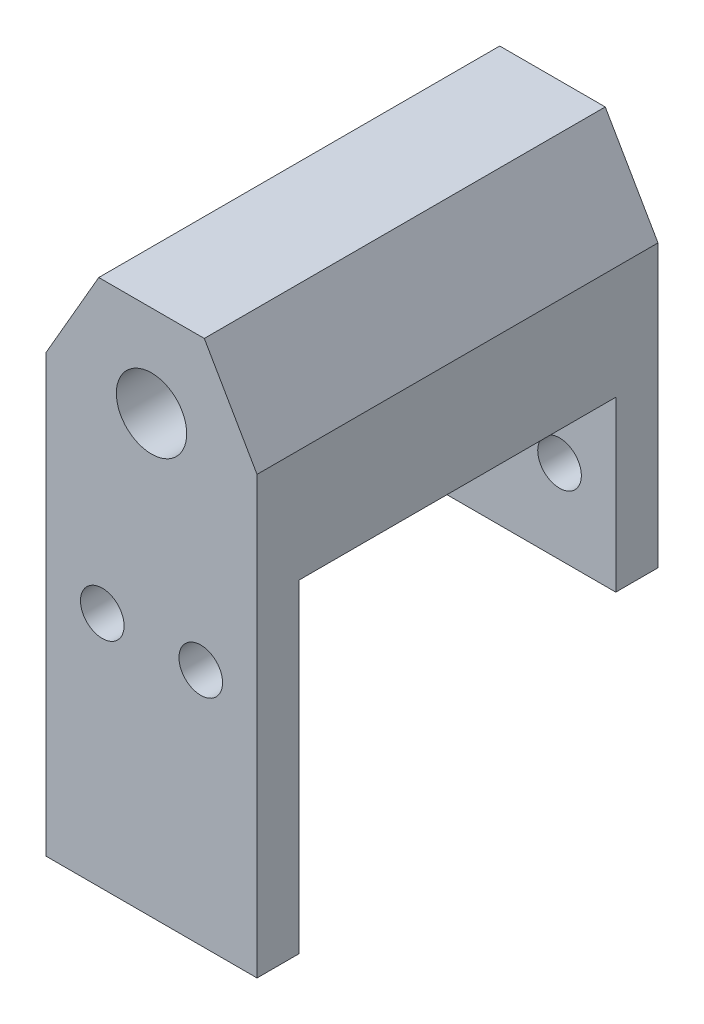
ISO-10303-21;
HEADER;
FILE_DESCRIPTION(('STEP AP214'),'2;1');
FILE_NAME('part.step','',(''),(''),'','','');
FILE_SCHEMA(('AUTOMOTIVE_DESIGN { 1 0 10303 214 1 1 1 1 }'));
ENDSEC;
DATA;
#1=APPLICATION_CONTEXT('core data for automotive mechanical design processes');
#2=APPLICATION_PROTOCOL_DEFINITION('international standard','automotive_design',2000,#1);
#3=PRODUCT_CONTEXT('',#1,'mechanical');
#4=PRODUCT('Part','Part','',(#3));
#5=PRODUCT_RELATED_PRODUCT_CATEGORY('part','',(#4));
#6=PRODUCT_DEFINITION_FORMATION('','',#4);
#7=PRODUCT_DEFINITION_CONTEXT('part definition',#1,'design');
#8=PRODUCT_DEFINITION('design','',#6,#7);
#9=PRODUCT_DEFINITION_SHAPE('','',#8);
#10=(LENGTH_UNIT() NAMED_UNIT(*) SI_UNIT(.MILLI.,.METRE.));
#11=(NAMED_UNIT(*) PLANE_ANGLE_UNIT() SI_UNIT($,.RADIAN.));
#12=(NAMED_UNIT(*) SI_UNIT($,.STERADIAN.) SOLID_ANGLE_UNIT());
#13=UNCERTAINTY_MEASURE_WITH_UNIT(LENGTH_MEASURE(1.E-05),#10,'distance_accuracy_value','');
#14=(GEOMETRIC_REPRESENTATION_CONTEXT(3) GLOBAL_UNCERTAINTY_ASSIGNED_CONTEXT((#13)) GLOBAL_UNIT_ASSIGNED_CONTEXT((#10,
#11,#12)) REPRESENTATION_CONTEXT('',''));
#15=CARTESIAN_POINT('',(0.,0.,0.));
#16=DIRECTION('',(0.,0.,1.));
#17=DIRECTION('',(1.,0.,0.));
#18=AXIS2_PLACEMENT_3D('',#15,#16,#17);
#19=CARTESIAN_POINT('',(-7.5,-8.,28.5));
#20=DIRECTION('',(0.,1.,0.));
#21=DIRECTION('',(0.,0.,1.));
#22=AXIS2_PLACEMENT_3D('',#19,#20,#21);
#23=PLANE('',#22);
#24=DIRECTION('',(-1.,0.,0.));
#25=VECTOR('',#24,1.);
#26=CARTESIAN_POINT('',(0.,-8.,3.));
#27=LINE('',#26,#25);
#28=CARTESIAN_POINT('',(7.5,-8.,3.00000000000001));
#29=VERTEX_POINT('',#28);
#30=CARTESIAN_POINT('',(-7.5,-8.,3.00000000000001));
#31=VERTEX_POINT('',#30);
#32=EDGE_CURVE('E62',#29,#31,#27,.T.);
#33=ORIENTED_EDGE('',*,*,#32,.F.);
#34=DIRECTION('',(0.,0.,-1.));
#35=VECTOR('',#34,1.);
#36=CARTESIAN_POINT('',(7.5,-8.,28.5));
#37=LINE('',#36,#35);
#38=CARTESIAN_POINT('',(7.5,-8.,25.5));
#39=VERTEX_POINT('',#38);
#40=EDGE_CURVE('E142',#39,#29,#37,.T.);
#41=ORIENTED_EDGE('',*,*,#40,.F.);
#42=DIRECTION('',(1.,0.,0.));
#43=VECTOR('',#42,1.);
#44=CARTESIAN_POINT('',(0.,-8.,25.5));
#45=LINE('',#44,#43);
#46=CARTESIAN_POINT('',(-7.5,-8.,25.5));
#47=VERTEX_POINT('',#46);
#48=EDGE_CURVE('E144',#47,#39,#45,.T.);
#49=ORIENTED_EDGE('',*,*,#48,.F.);
#50=DIRECTION('',(0.,0.,-1.));
#51=VECTOR('',#50,1.);
#52=CARTESIAN_POINT('',(-7.5,-8.,28.5));
#53=LINE('',#52,#51);
#54=EDGE_CURVE('E51',#47,#31,#53,.T.);
#55=ORIENTED_EDGE('',*,*,#54,.T.);
#56=EDGE_LOOP('',(#33,#41,#49,#55));
#57=FACE_BOUND('',#56,.T.);
#58=ADVANCED_FACE('F41',(#57),#23,.F.);
#59=CARTESIAN_POINT('',(-3.75000000000008,6.49519052838325,28.5));
#60=DIRECTION('',(0.86602540378444,-0.499999999999998,0.));
#61=DIRECTION('',(0.499999999999998,0.86602540378444,0.));
#62=AXIS2_PLACEMENT_3D('',#59,#60,#61);
#63=PLANE('',#62);
#64=DIRECTION('',(-0.499999999999998,-0.86602540378444,0.));
#65=VECTOR('',#64,1.);
#66=CARTESIAN_POINT('',(-3.75000000000008,6.49519052838325,0.));
#67=LINE('',#66,#65);
#68=CARTESIAN_POINT('',(-3.75000000000008,6.49519052838325,0.));
#69=VERTEX_POINT('',#68);
#70=CARTESIAN_POINT('',(-7.5,0.,0.));
#71=VERTEX_POINT('',#70);
#72=EDGE_CURVE('E176',#69,#71,#67,.T.);
#73=ORIENTED_EDGE('',*,*,#72,.T.);
#74=DIRECTION('',(0.,0.,-1.));
#75=VECTOR('',#74,1.);
#76=CARTESIAN_POINT('',(-7.5,0.,28.5));
#77=LINE('',#76,#75);
#78=CARTESIAN_POINT('',(-7.5,0.,28.5));
#79=VERTEX_POINT('',#78);
#80=EDGE_CURVE('E11',#79,#71,#77,.T.);
#81=ORIENTED_EDGE('',*,*,#80,.F.);
#82=DIRECTION('',(-0.499999999999998,-0.86602540378444,0.));
#83=VECTOR('',#82,1.);
#84=CARTESIAN_POINT('',(-3.75000000000008,6.49519052838325,28.5));
#85=LINE('',#84,#83);
#86=CARTESIAN_POINT('',(-3.75000000000008,6.49519052838325,28.5));
#87=VERTEX_POINT('',#86);
#88=EDGE_CURVE('E177',#87,#79,#85,.T.);
#89=ORIENTED_EDGE('',*,*,#88,.F.);
#90=DIRECTION('',(0.,0.,-1.));
#91=VECTOR('',#90,1.);
#92=CARTESIAN_POINT('',(-3.75000000000008,6.49519052838325,28.5));
#93=LINE('',#92,#91);
#94=EDGE_CURVE('E194',#87,#69,#93,.T.);
#95=ORIENTED_EDGE('',*,*,#94,.T.);
#96=EDGE_LOOP('',(#73,#81,#89,#95));
#97=FACE_BOUND('',#96,.T.);
#98=ADVANCED_FACE('F43',(#97),#63,.F.);
#99=CARTESIAN_POINT('',(-7.5,0.,28.5));
#100=DIRECTION('',(1.,0.,0.));
#101=DIRECTION('',(0.,1.,0.));
#102=AXIS2_PLACEMENT_3D('',#99,#100,#101);
#103=PLANE('',#102);
#104=DIRECTION('',(0.,-1.,0.));
#105=VECTOR('',#104,1.);
#106=CARTESIAN_POINT('',(-7.5,0.,0.));
#107=LINE('',#106,#105);
#108=CARTESIAN_POINT('',(-7.5,-20.,0.));
#109=VERTEX_POINT('',#108);
#110=EDGE_CURVE('E198',#71,#109,#107,.T.);
#111=ORIENTED_EDGE('',*,*,#110,.T.);
#112=DIRECTION('',(0.,0.,-1.));
#113=VECTOR('',#112,1.);
#114=CARTESIAN_POINT('',(-7.5,-20.,0.));
#115=LINE('',#114,#113);
#116=CARTESIAN_POINT('',(-7.5,-20.,3.));
#117=VERTEX_POINT('',#116);
#118=EDGE_CURVE('E129',#117,#109,#115,.T.);
#119=ORIENTED_EDGE('',*,*,#118,.F.);
#120=DIRECTION('',(0.,1.,0.));
#121=VECTOR('',#120,1.);
#122=CARTESIAN_POINT('',(-7.5,-20.,3.));
#123=LINE('',#122,#121);
#124=EDGE_CURVE('E124',#117,#31,#123,.T.);
#125=ORIENTED_EDGE('',*,*,#124,.T.);
#126=ORIENTED_EDGE('',*,*,#54,.F.);
#127=DIRECTION('',(0.,1.,0.));
#128=VECTOR('',#127,1.);
#129=CARTESIAN_POINT('',(-7.5,-31.,25.5));
#130=LINE('',#129,#128);
#131=CARTESIAN_POINT('',(-7.5,-31.,25.5));
#132=VERTEX_POINT('',#131);
#133=EDGE_CURVE('E172',#132,#47,#130,.T.);
#134=ORIENTED_EDGE('',*,*,#133,.F.);
#135=DIRECTION('',(0.,0.,-1.));
#136=VECTOR('',#135,1.);
#137=CARTESIAN_POINT('',(-7.5,-31.,0.));
#138=LINE('',#137,#136);
#139=CARTESIAN_POINT('',(-7.5,-31.,28.5));
#140=VERTEX_POINT('',#139);
#141=EDGE_CURVE('E150',#140,#132,#138,.T.);
#142=ORIENTED_EDGE('',*,*,#141,.F.);
#143=DIRECTION('',(0.,-1.,0.));
#144=VECTOR('',#143,1.);
#145=CARTESIAN_POINT('',(-7.5,0.,28.5));
#146=LINE('',#145,#144);
#147=EDGE_CURVE('E181',#79,#140,#146,.T.);
#148=ORIENTED_EDGE('',*,*,#147,.F.);
#149=ORIENTED_EDGE('',*,*,#80,.T.);
#150=EDGE_LOOP('',(#111,#119,#125,#126,#134,#142,#148,#149));
#151=FACE_BOUND('',#150,.T.);
#152=ADVANCED_FACE('F266',(#151),#103,.F.);
#153=CARTESIAN_POINT('',(7.5,-8.,28.5));
#154=DIRECTION('',(-1.,0.,0.));
#155=DIRECTION('',(0.,0.,1.));
#156=AXIS2_PLACEMENT_3D('',#153,#154,#155);
#157=PLANE('',#156);
#158=DIRECTION('',(0.,1.,0.));
#159=VECTOR('',#158,1.);
#160=CARTESIAN_POINT('',(7.5,-8.,0.));
#161=LINE('',#160,#159);
#162=CARTESIAN_POINT('',(7.5,-20.,0.));
#163=VERTEX_POINT('',#162);
#164=CARTESIAN_POINT('',(7.5,0.,0.));
#165=VERTEX_POINT('',#164);
#166=EDGE_CURVE('E201',#163,#165,#161,.T.);
#167=ORIENTED_EDGE('',*,*,#166,.T.);
#168=DIRECTION('',(0.,0.,-1.));
#169=VECTOR('',#168,1.);
#170=CARTESIAN_POINT('',(7.5,0.,28.5));
#171=LINE('',#170,#169);
#172=CARTESIAN_POINT('',(7.5,0.,28.5));
#173=VERTEX_POINT('',#172);
#174=EDGE_CURVE('E216',#173,#165,#171,.T.);
#175=ORIENTED_EDGE('',*,*,#174,.F.);
#176=DIRECTION('',(0.,1.,0.));
#177=VECTOR('',#176,1.);
#178=CARTESIAN_POINT('',(7.5,-8.,28.5));
#179=LINE('',#178,#177);
#180=CARTESIAN_POINT('',(7.5,-31.,28.5));
#181=VERTEX_POINT('',#180);
#182=EDGE_CURVE('E185',#181,#173,#179,.T.);
#183=ORIENTED_EDGE('',*,*,#182,.F.);
#184=DIRECTION('',(0.,0.,1.));
#185=VECTOR('',#184,1.);
#186=CARTESIAN_POINT('',(7.5,-31.,0.));
#187=LINE('',#186,#185);
#188=CARTESIAN_POINT('',(7.5,-31.,25.5));
#189=VERTEX_POINT('',#188);
#190=EDGE_CURVE('E161',#189,#181,#187,.T.);
#191=ORIENTED_EDGE('',*,*,#190,.F.);
#192=DIRECTION('',(0.,1.,0.));
#193=VECTOR('',#192,1.);
#194=CARTESIAN_POINT('',(7.5,-31.,25.5));
#195=LINE('',#194,#193);
#196=EDGE_CURVE('E168',#189,#39,#195,.T.);
#197=ORIENTED_EDGE('',*,*,#196,.T.);
#198=ORIENTED_EDGE('',*,*,#40,.T.);
#199=DIRECTION('',(0.,1.,0.));
#200=VECTOR('',#199,1.);
#201=CARTESIAN_POINT('',(7.5,-20.,3.));
#202=LINE('',#201,#200);
#203=CARTESIAN_POINT('',(7.5,-20.,3.));
#204=VERTEX_POINT('',#203);
#205=EDGE_CURVE('E122',#204,#29,#202,.T.);
#206=ORIENTED_EDGE('',*,*,#205,.F.);
#207=DIRECTION('',(0.,0.,1.));
#208=VECTOR('',#207,1.);
#209=CARTESIAN_POINT('',(7.5,-20.,0.));
#210=LINE('',#209,#208);
#211=EDGE_CURVE('E130',#163,#204,#210,.T.);
#212=ORIENTED_EDGE('',*,*,#211,.F.);
#213=EDGE_LOOP('',(#167,#175,#183,#191,#197,#198,#206,#212));
#214=FACE_BOUND('',#213,.T.);
#215=ADVANCED_FACE('F140',(#214),#157,.F.);
#216=CARTESIAN_POINT('',(7.5,0.,28.5));
#217=DIRECTION('',(-0.866025403784435,-0.500000000000007,0.));
#218=DIRECTION('',(0.500000000000007,-0.866025403784435,0.));
#219=AXIS2_PLACEMENT_3D('',#216,#217,#218);
#220=PLANE('',#219);
#221=DIRECTION('',(-0.500000000000007,0.866025403784435,0.));
#222=VECTOR('',#221,1.);
#223=CARTESIAN_POINT('',(7.5,0.,0.));
#224=LINE('',#223,#222);
#225=CARTESIAN_POINT('',(3.74999999999994,6.49519052838332,0.));
#226=VERTEX_POINT('',#225);
#227=EDGE_CURVE('E204',#165,#226,#224,.T.);
#228=ORIENTED_EDGE('',*,*,#227,.T.);
#229=DIRECTION('',(0.,0.,-1.));
#230=VECTOR('',#229,1.);
#231=CARTESIAN_POINT('',(3.74999999999994,6.49519052838332,28.5));
#232=LINE('',#231,#230);
#233=CARTESIAN_POINT('',(3.74999999999994,6.49519052838332,28.5));
#234=VERTEX_POINT('',#233);
#235=EDGE_CURVE('E212',#234,#226,#232,.T.);
#236=ORIENTED_EDGE('',*,*,#235,.F.);
#237=DIRECTION('',(-0.500000000000007,0.866025403784435,0.));
#238=VECTOR('',#237,1.);
#239=CARTESIAN_POINT('',(7.5,0.,28.5));
#240=LINE('',#239,#238);
#241=EDGE_CURVE('E188',#173,#234,#240,.T.);
#242=ORIENTED_EDGE('',*,*,#241,.F.);
#243=ORIENTED_EDGE('',*,*,#174,.T.);
#244=EDGE_LOOP('',(#228,#236,#242,#243));
#245=FACE_BOUND('',#244,.T.);
#246=ADVANCED_FACE('F276',(#245),#220,.F.);
#247=CARTESIAN_POINT('',(3.74999999999994,6.49519052838332,28.5));
#248=DIRECTION('',(0.,-1.,0.));
#249=DIRECTION('',(1.,0.,0.));
#250=AXIS2_PLACEMENT_3D('',#247,#248,#249);
#251=PLANE('',#250);
#252=DIRECTION('',(-1.,0.,0.));
#253=VECTOR('',#252,1.);
#254=CARTESIAN_POINT('',(3.74999999999994,6.49519052838332,0.));
#255=LINE('',#254,#253);
#256=EDGE_CURVE('E182',#226,#69,#255,.T.);
#257=ORIENTED_EDGE('',*,*,#256,.T.);
#258=ORIENTED_EDGE('',*,*,#94,.F.);
#259=DIRECTION('',(-1.,0.,0.));
#260=VECTOR('',#259,1.);
#261=CARTESIAN_POINT('',(3.74999999999994,6.49519052838332,28.5));
#262=LINE('',#261,#260);
#263=EDGE_CURVE('E191',#234,#87,#262,.T.);
#264=ORIENTED_EDGE('',*,*,#263,.F.);
#265=ORIENTED_EDGE('',*,*,#235,.T.);
#266=EDGE_LOOP('',(#257,#258,#264,#265));
#267=FACE_BOUND('',#266,.T.);
#268=ADVANCED_FACE('F305',(#267),#251,.F.);
#269=CARTESIAN_POINT('',(0.,0.,28.5));
#270=DIRECTION('',(0.,0.,1.));
#271=DIRECTION('',(1.,0.,0.));
#272=AXIS2_PLACEMENT_3D('',#269,#270,#271);
#273=PLANE('',#272);
#274=CARTESIAN_POINT('',(0.,0.,28.5));
#275=DIRECTION('',(0.,0.,1.));
#276=DIRECTION('',(1.,0.,0.));
#277=AXIS2_PLACEMENT_3D('',#274,#275,#276);
#278=CIRCLE('',#277,2.49999999999999);
#279=CARTESIAN_POINT('',(2.49999999999999,0.,28.5));
#280=VERTEX_POINT('',#279);
#281=EDGE_CURVE('E348',#280,#280,#278,.T.);
#282=ORIENTED_EDGE('',*,*,#281,.F.);
#283=EDGE_LOOP('',(#282));
#284=FACE_BOUND('',#283,.T.);
#285=CARTESIAN_POINT('',(3.5,-14.05,28.5));
#286=DIRECTION('',(0.,0.,-1.));
#287=DIRECTION('',(-1.,0.,0.));
#288=AXIS2_PLACEMENT_3D('',#285,#286,#287);
#289=CIRCLE('',#288,1.55);
#290=CARTESIAN_POINT('',(1.95,-14.05,28.5));
#291=VERTEX_POINT('',#290);
#292=EDGE_CURVE('E227',#291,#291,#289,.T.);
#293=ORIENTED_EDGE('',*,*,#292,.T.);
#294=EDGE_LOOP('',(#293));
#295=FACE_BOUND('',#294,.T.);
#296=CARTESIAN_POINT('',(-3.5,-14.05,28.5));
#297=DIRECTION('',(0.,0.,-1.));
#298=DIRECTION('',(-1.,0.,0.));
#299=AXIS2_PLACEMENT_3D('',#296,#297,#298);
#300=CIRCLE('',#299,1.55);
#301=CARTESIAN_POINT('',(-5.05,-14.05,28.5));
#302=VERTEX_POINT('',#301);
#303=EDGE_CURVE('E243',#302,#302,#300,.T.);
#304=ORIENTED_EDGE('',*,*,#303,.T.);
#305=EDGE_LOOP('',(#304));
#306=FACE_BOUND('',#305,.T.);
#307=ORIENTED_EDGE('',*,*,#88,.T.);
#308=ORIENTED_EDGE('',*,*,#147,.T.);
#309=DIRECTION('',(-1.,0.,0.));
#310=VECTOR('',#309,1.);
#311=CARTESIAN_POINT('',(0.,-31.,28.5));
#312=LINE('',#311,#310);
#313=EDGE_CURVE('E165',#181,#140,#312,.T.);
#314=ORIENTED_EDGE('',*,*,#313,.F.);
#315=ORIENTED_EDGE('',*,*,#182,.T.);
#316=ORIENTED_EDGE('',*,*,#241,.T.);
#317=ORIENTED_EDGE('',*,*,#263,.T.);
#318=EDGE_LOOP('',(#307,#308,#314,#315,#316,#317));
#319=FACE_BOUND('',#318,.T.);
#320=ADVANCED_FACE('F280',(#284,#295,#306,#319),#273,.T.);
#321=CARTESIAN_POINT('',(0.,0.,0.));
#322=DIRECTION('',(0.,0.,1.));
#323=DIRECTION('',(1.,0.,0.));
#324=AXIS2_PLACEMENT_3D('',#321,#322,#323);
#325=PLANE('',#324);
#326=CARTESIAN_POINT('',(0.,0.,0.));
#327=DIRECTION('',(0.,0.,-1.));
#328=DIRECTION('',(-1.,0.,0.));
#329=AXIS2_PLACEMENT_3D('',#326,#327,#328);
#330=CIRCLE('',#329,2.49999999999999);
#331=CARTESIAN_POINT('',(-2.49999999999999,0.,0.));
#332=VERTEX_POINT('',#331);
#333=EDGE_CURVE('E246',#332,#332,#330,.T.);
#334=ORIENTED_EDGE('',*,*,#333,.F.);
#335=EDGE_LOOP('',(#334));
#336=FACE_BOUND('',#335,.T.);
#337=CARTESIAN_POINT('',(3.5,-14.05,0.));
#338=DIRECTION('',(0.,0.,-1.));
#339=DIRECTION('',(-1.,0.,0.));
#340=AXIS2_PLACEMENT_3D('',#337,#338,#339);
#341=CIRCLE('',#340,1.55);
#342=CARTESIAN_POINT('',(1.95,-14.05,0.));
#343=VERTEX_POINT('',#342);
#344=EDGE_CURVE('E236',#343,#343,#341,.T.);
#345=ORIENTED_EDGE('',*,*,#344,.F.);
#346=EDGE_LOOP('',(#345));
#347=FACE_BOUND('',#346,.T.);
#348=CARTESIAN_POINT('',(-3.5,-14.05,0.));
#349=DIRECTION('',(0.,0.,-1.));
#350=DIRECTION('',(-1.,0.,0.));
#351=AXIS2_PLACEMENT_3D('',#348,#349,#350);
#352=CIRCLE('',#351,1.55);
#353=CARTESIAN_POINT('',(-5.05,-14.05,0.));
#354=VERTEX_POINT('',#353);
#355=EDGE_CURVE('E252',#354,#354,#352,.T.);
#356=ORIENTED_EDGE('',*,*,#355,.F.);
#357=EDGE_LOOP('',(#356));
#358=FACE_BOUND('',#357,.T.);
#359=ORIENTED_EDGE('',*,*,#72,.F.);
#360=ORIENTED_EDGE('',*,*,#256,.F.);
#361=ORIENTED_EDGE('',*,*,#227,.F.);
#362=ORIENTED_EDGE('',*,*,#166,.F.);
#363=DIRECTION('',(1.,0.,0.));
#364=VECTOR('',#363,1.);
#365=CARTESIAN_POINT('',(0.,-20.,0.));
#366=LINE('',#365,#364);
#367=EDGE_CURVE('E136',#109,#163,#366,.T.);
#368=ORIENTED_EDGE('',*,*,#367,.F.);
#369=ORIENTED_EDGE('',*,*,#110,.F.);
#370=EDGE_LOOP('',(#359,#360,#361,#362,#368,#369));
#371=FACE_BOUND('',#370,.T.);
#372=ADVANCED_FACE('F270',(#336,#347,#358,#371),#325,.F.);
#373=CARTESIAN_POINT('',(0.,-31.,25.5));
#374=DIRECTION('',(0.,0.,1.));
#375=DIRECTION('',(1.,0.,0.));
#376=AXIS2_PLACEMENT_3D('',#373,#374,#375);
#377=PLANE('',#376);
#378=CARTESIAN_POINT('',(3.5,-14.05,25.5));
#379=DIRECTION('',(0.,0.,1.));
#380=DIRECTION('',(1.,0.,0.));
#381=AXIS2_PLACEMENT_3D('',#378,#379,#380);
#382=CIRCLE('',#381,1.55);
#383=CARTESIAN_POINT('',(5.05,-14.05,25.5));
#384=VERTEX_POINT('',#383);
#385=EDGE_CURVE('E256',#384,#384,#382,.T.);
#386=ORIENTED_EDGE('',*,*,#385,.T.);
#387=EDGE_LOOP('',(#386));
#388=FACE_BOUND('',#387,.T.);
#389=CARTESIAN_POINT('',(-3.5,-14.05,25.5));
#390=DIRECTION('',(0.,0.,1.));
#391=DIRECTION('',(1.,0.,0.));
#392=AXIS2_PLACEMENT_3D('',#389,#390,#391);
#393=CIRCLE('',#392,1.55);
#394=CARTESIAN_POINT('',(-1.95,-14.05,25.5));
#395=VERTEX_POINT('',#394);
#396=EDGE_CURVE('E226',#395,#395,#393,.T.);
#397=ORIENTED_EDGE('',*,*,#396,.T.);
#398=EDGE_LOOP('',(#397));
#399=FACE_BOUND('',#398,.T.);
#400=ORIENTED_EDGE('',*,*,#48,.T.);
#401=ORIENTED_EDGE('',*,*,#196,.F.);
#402=DIRECTION('',(1.,0.,0.));
#403=VECTOR('',#402,1.);
#404=CARTESIAN_POINT('',(0.,-31.,25.5));
#405=LINE('',#404,#403);
#406=EDGE_CURVE('E158',#132,#189,#405,.T.);
#407=ORIENTED_EDGE('',*,*,#406,.F.);
#408=ORIENTED_EDGE('',*,*,#133,.T.);
#409=EDGE_LOOP('',(#400,#401,#407,#408));
#410=FACE_BOUND('',#409,.T.);
#411=ADVANCED_FACE('F289',(#388,#399,#410),#377,.F.);
#412=CARTESIAN_POINT('',(0.,-31.,0.));
#413=DIRECTION('',(0.,-1.,0.));
#414=DIRECTION('',(0.,0.,-1.));
#415=AXIS2_PLACEMENT_3D('',#412,#413,#414);
#416=PLANE('',#415);
#417=ORIENTED_EDGE('',*,*,#141,.T.);
#418=ORIENTED_EDGE('',*,*,#406,.T.);
#419=ORIENTED_EDGE('',*,*,#190,.T.);
#420=ORIENTED_EDGE('',*,*,#313,.T.);
#421=EDGE_LOOP('',(#417,#418,#419,#420));
#422=FACE_BOUND('',#421,.T.);
#423=ADVANCED_FACE('F285',(#422),#416,.T.);
#424=CARTESIAN_POINT('',(0.,-20.,3.));
#425=DIRECTION('',(0.,0.,-1.));
#426=DIRECTION('',(-1.,0.,0.));
#427=AXIS2_PLACEMENT_3D('',#424,#425,#426);
#428=PLANE('',#427);
#429=CARTESIAN_POINT('',(3.5,-14.05,3.));
#430=DIRECTION('',(0.,0.,-1.));
#431=DIRECTION('',(-1.,0.,0.));
#432=AXIS2_PLACEMENT_3D('',#429,#430,#431);
#433=CIRCLE('',#432,1.55);
#434=CARTESIAN_POINT('',(1.95,-14.05,3.));
#435=VERTEX_POINT('',#434);
#436=EDGE_CURVE('E45',#435,#435,#433,.T.);
#437=ORIENTED_EDGE('',*,*,#436,.T.);
#438=EDGE_LOOP('',(#437));
#439=FACE_BOUND('',#438,.T.);
#440=CARTESIAN_POINT('',(-3.5,-14.05,3.));
#441=DIRECTION('',(0.,0.,-1.));
#442=DIRECTION('',(-1.,0.,0.));
#443=AXIS2_PLACEMENT_3D('',#440,#441,#442);
#444=CIRCLE('',#443,1.55);
#445=CARTESIAN_POINT('',(-5.05,-14.05,3.));
#446=VERTEX_POINT('',#445);
#447=EDGE_CURVE('E223',#446,#446,#444,.T.);
#448=ORIENTED_EDGE('',*,*,#447,.T.);
#449=EDGE_LOOP('',(#448));
#450=FACE_BOUND('',#449,.T.);
#451=ORIENTED_EDGE('',*,*,#32,.T.);
#452=ORIENTED_EDGE('',*,*,#124,.F.);
#453=DIRECTION('',(-1.,0.,0.));
#454=VECTOR('',#453,1.);
#455=CARTESIAN_POINT('',(0.,-20.,3.));
#456=LINE('',#455,#454);
#457=EDGE_CURVE('E118',#204,#117,#456,.T.);
#458=ORIENTED_EDGE('',*,*,#457,.F.);
#459=ORIENTED_EDGE('',*,*,#205,.T.);
#460=EDGE_LOOP('',(#451,#452,#458,#459));
#461=FACE_BOUND('',#460,.T.);
#462=ADVANCED_FACE('F120',(#439,#450,#461),#428,.F.);
#463=CARTESIAN_POINT('',(0.,-20.,0.));
#464=DIRECTION('',(0.,-1.,0.));
#465=DIRECTION('',(0.,0.,-1.));
#466=AXIS2_PLACEMENT_3D('',#463,#464,#465);
#467=PLANE('',#466);
#468=ORIENTED_EDGE('',*,*,#211,.T.);
#469=ORIENTED_EDGE('',*,*,#457,.T.);
#470=ORIENTED_EDGE('',*,*,#118,.T.);
#471=ORIENTED_EDGE('',*,*,#367,.T.);
#472=EDGE_LOOP('',(#468,#469,#470,#471));
#473=FACE_BOUND('',#472,.T.);
#474=ADVANCED_FACE('F134',(#473),#467,.T.);
#475=CARTESIAN_POINT('',(-3.5,-14.05,28.5));
#476=DIRECTION('',(0.,0.,-1.));
#477=DIRECTION('',(-1.,0.,0.));
#478=AXIS2_PLACEMENT_3D('',#475,#476,#477);
#479=CYLINDRICAL_SURFACE('',#478,1.55);
#480=ORIENTED_EDGE('',*,*,#355,.T.);
#481=EDGE_LOOP('',(#480));
#482=FACE_BOUND('',#481,.T.);
#483=ORIENTED_EDGE('',*,*,#447,.F.);
#484=EDGE_LOOP('',(#483));
#485=FACE_BOUND('',#484,.T.);
#486=ADVANCED_FACE('F328',(#482,#485),#479,.F.);
#487=CARTESIAN_POINT('',(3.5,-14.05,28.5));
#488=DIRECTION('',(0.,0.,-1.));
#489=DIRECTION('',(-1.,0.,0.));
#490=AXIS2_PLACEMENT_3D('',#487,#488,#489);
#491=CYLINDRICAL_SURFACE('',#490,1.55);
#492=ORIENTED_EDGE('',*,*,#344,.T.);
#493=EDGE_LOOP('',(#492));
#494=FACE_BOUND('',#493,.T.);
#495=ORIENTED_EDGE('',*,*,#436,.F.);
#496=EDGE_LOOP('',(#495));
#497=FACE_BOUND('',#496,.T.);
#498=ADVANCED_FACE('F333',(#494,#497),#491,.F.);
#499=ORIENTED_EDGE('',*,*,#303,.F.);
#500=EDGE_LOOP('',(#499));
#501=FACE_BOUND('',#500,.T.);
#502=ORIENTED_EDGE('',*,*,#396,.F.);
#503=EDGE_LOOP('',(#502));
#504=FACE_BOUND('',#503,.T.);
#505=ADVANCED_FACE('F329',(#501,#504),#479,.F.);
#506=ORIENTED_EDGE('',*,*,#292,.F.);
#507=EDGE_LOOP('',(#506));
#508=FACE_BOUND('',#507,.T.);
#509=ORIENTED_EDGE('',*,*,#385,.F.);
#510=EDGE_LOOP('',(#509));
#511=FACE_BOUND('',#510,.T.);
#512=ADVANCED_FACE('F332',(#508,#511),#491,.F.);
#513=CARTESIAN_POINT('',(0.,0.,0.));
#514=DIRECTION('',(0.,0.,-1.));
#515=DIRECTION('',(-1.,0.,0.));
#516=AXIS2_PLACEMENT_3D('',#513,#514,#515);
#517=CYLINDRICAL_SURFACE('',#516,2.49999999999999);
#518=ORIENTED_EDGE('',*,*,#333,.T.);
#519=EDGE_LOOP('',(#518));
#520=FACE_BOUND('',#519,.T.);
#521=ORIENTED_EDGE('',*,*,#281,.T.);
#522=EDGE_LOOP('',(#521));
#523=FACE_BOUND('',#522,.T.);
#524=ADVANCED_FACE('F337',(#520,#523),#517,.F.);
#525=CLOSED_SHELL('',(#58,#98,#152,#215,#246,#268,#320,#372,#411,#423,#462,#474,#486,#498,#505,
#512,#524));
#526=MANIFOLD_SOLID_BREP('B2',#525);
#527=ADVANCED_BREP_SHAPE_REPRESENTATION('',(#18,#526),#14);
#528=SHAPE_DEFINITION_REPRESENTATION(#9,#527);
ENDSEC;
END-ISO-10303-21;
